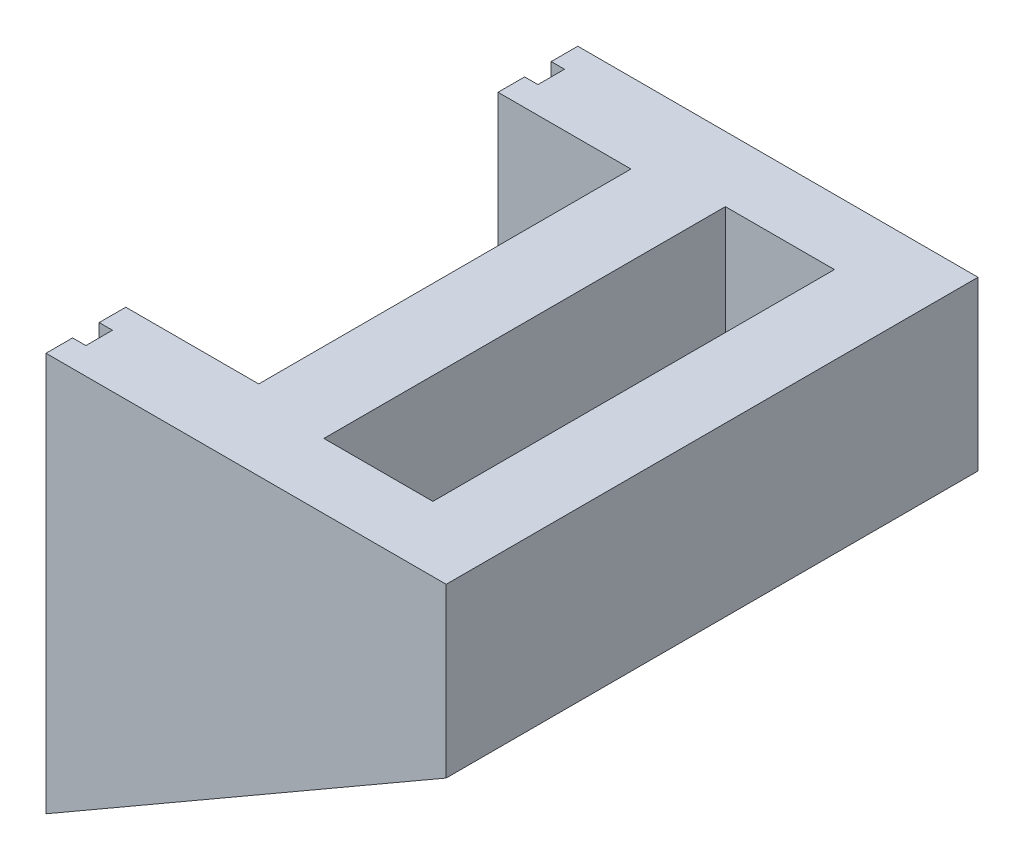
ISO-10303-21;
HEADER;
FILE_DESCRIPTION(('STEP AP214'),'2;1');
FILE_NAME('part.step','',(''),(''),'','','');
FILE_SCHEMA(('AUTOMOTIVE_DESIGN { 1 0 10303 214 1 1 1 1 }'));
ENDSEC;
DATA;
#1=APPLICATION_CONTEXT('core data for automotive mechanical design processes');
#2=APPLICATION_PROTOCOL_DEFINITION('international standard','automotive_design',2000,#1);
#3=PRODUCT_CONTEXT('',#1,'mechanical');
#4=PRODUCT('Part','Part','',(#3));
#5=PRODUCT_RELATED_PRODUCT_CATEGORY('part','',(#4));
#6=PRODUCT_DEFINITION_FORMATION('','',#4);
#7=PRODUCT_DEFINITION_CONTEXT('part definition',#1,'design');
#8=PRODUCT_DEFINITION('design','',#6,#7);
#9=PRODUCT_DEFINITION_SHAPE('','',#8);
#10=(LENGTH_UNIT() NAMED_UNIT(*) SI_UNIT(.MILLI.,.METRE.));
#11=(NAMED_UNIT(*) PLANE_ANGLE_UNIT() SI_UNIT($,.RADIAN.));
#12=(NAMED_UNIT(*) SI_UNIT($,.STERADIAN.) SOLID_ANGLE_UNIT());
#13=UNCERTAINTY_MEASURE_WITH_UNIT(LENGTH_MEASURE(1.E-05),#10,'distance_accuracy_value','');
#14=(GEOMETRIC_REPRESENTATION_CONTEXT(3) GLOBAL_UNCERTAINTY_ASSIGNED_CONTEXT((#13)) GLOBAL_UNIT_ASSIGNED_CONTEXT((#10,
#11,#12)) REPRESENTATION_CONTEXT('',''));
#15=CARTESIAN_POINT('',(0.,0.,0.));
#16=DIRECTION('',(0.,0.,1.));
#17=DIRECTION('',(1.,0.,0.));
#18=AXIS2_PLACEMENT_3D('',#15,#16,#17);
#19=CARTESIAN_POINT('',(0.,15.,0.));
#20=DIRECTION('',(0.,-1.,0.));
#21=DIRECTION('',(0.,0.,-1.));
#22=AXIS2_PLACEMENT_3D('',#19,#20,#21);
#23=PLANE('',#22);
#24=DIRECTION('',(0.,0.,-1.));
#25=VECTOR('',#24,1.);
#26=CARTESIAN_POINT('',(-2.05,15.,10.));
#27=LINE('',#26,#25);
#28=CARTESIAN_POINT('',(-2.05,15.,7.55));
#29=VERTEX_POINT('',#28);
#30=CARTESIAN_POINT('',(-2.05,15.,-7.55));
#31=VERTEX_POINT('',#30);
#32=EDGE_CURVE('E255',#29,#31,#27,.T.);
#33=ORIENTED_EDGE('',*,*,#32,.T.);
#34=DIRECTION('',(-1.,0.,0.));
#35=VECTOR('',#34,1.);
#36=CARTESIAN_POINT('',(-2.05,15.,-7.55));
#37=LINE('',#36,#35);
#38=CARTESIAN_POINT('',(2.05,15.,-7.55));
#39=VERTEX_POINT('',#38);
#40=EDGE_CURVE('E283',#39,#31,#37,.T.);
#41=ORIENTED_EDGE('',*,*,#40,.F.);
#42=DIRECTION('',(0.,0.,-1.));
#43=VECTOR('',#42,1.);
#44=CARTESIAN_POINT('',(2.05,15.,7.55));
#45=LINE('',#44,#43);
#46=CARTESIAN_POINT('',(2.05,15.,7.55));
#47=VERTEX_POINT('',#46);
#48=EDGE_CURVE('E260',#47,#39,#45,.T.);
#49=ORIENTED_EDGE('',*,*,#48,.F.);
#50=DIRECTION('',(1.,0.,0.));
#51=VECTOR('',#50,1.);
#52=CARTESIAN_POINT('',(-2.05,15.,7.55));
#53=LINE('',#52,#51);
#54=EDGE_CURVE('E285',#29,#47,#53,.T.);
#55=ORIENTED_EDGE('',*,*,#54,.F.);
#56=EDGE_LOOP('',(#33,#41,#49,#55));
#57=FACE_BOUND('',#56,.T.);
#58=DIRECTION('',(-1.,0.,0.));
#59=VECTOR('',#58,1.);
#60=CARTESIAN_POINT('',(-9.55,15.,9.00000000000001));
#61=LINE('',#60,#59);
#62=CARTESIAN_POINT('',(-9.55,15.,9.00000000000001));
#63=VERTEX_POINT('',#62);
#64=CARTESIAN_POINT('',(-10.05,15.,9.00000000000001));
#65=VERTEX_POINT('',#64);
#66=EDGE_CURVE('E207',#63,#65,#61,.T.);
#67=ORIENTED_EDGE('',*,*,#66,.T.);
#68=DIRECTION('',(0.,0.,-1.));
#69=VECTOR('',#68,1.);
#70=CARTESIAN_POINT('',(-10.05,15.,7.));
#71=LINE('',#70,#69);
#72=CARTESIAN_POINT('',(-10.05,15.,10.));
#73=VERTEX_POINT('',#72);
#74=EDGE_CURVE('E235',#73,#65,#71,.T.);
#75=ORIENTED_EDGE('',*,*,#74,.F.);
#76=DIRECTION('',(1.,0.,0.));
#77=VECTOR('',#76,1.);
#78=CARTESIAN_POINT('',(-5.,15.,10.));
#79=LINE('',#78,#77);
#80=CARTESIAN_POINT('',(5.,15.,10.));
#81=VERTEX_POINT('',#80);
#82=EDGE_CURVE('E310',#73,#81,#79,.T.);
#83=ORIENTED_EDGE('',*,*,#82,.T.);
#84=DIRECTION('',(0.,0.,-1.));
#85=VECTOR('',#84,1.);
#86=CARTESIAN_POINT('',(5.,15.,10.));
#87=LINE('',#86,#85);
#88=CARTESIAN_POINT('',(5.,15.,-10.));
#89=VERTEX_POINT('',#88);
#90=EDGE_CURVE('E300',#81,#89,#87,.T.);
#91=ORIENTED_EDGE('',*,*,#90,.T.);
#92=DIRECTION('',(-1.,0.,0.));
#93=VECTOR('',#92,1.);
#94=CARTESIAN_POINT('',(-5.,15.,-10.));
#95=LINE('',#94,#93);
#96=CARTESIAN_POINT('',(-10.05,15.,-10.));
#97=VERTEX_POINT('',#96);
#98=EDGE_CURVE('E307',#89,#97,#95,.T.);
#99=ORIENTED_EDGE('',*,*,#98,.T.);
#100=DIRECTION('',(0.,0.,-1.));
#101=VECTOR('',#100,1.);
#102=CARTESIAN_POINT('',(-10.05,15.,-7.));
#103=LINE('',#102,#101);
#104=CARTESIAN_POINT('',(-10.05,15.,-9.));
#105=VERTEX_POINT('',#104);
#106=EDGE_CURVE('E221',#105,#97,#103,.T.);
#107=ORIENTED_EDGE('',*,*,#106,.F.);
#108=DIRECTION('',(-1.,0.,0.));
#109=VECTOR('',#108,1.);
#110=CARTESIAN_POINT('',(-9.55,15.,-9.));
#111=LINE('',#110,#109);
#112=CARTESIAN_POINT('',(-9.55,15.,-9.));
#113=VERTEX_POINT('',#112);
#114=EDGE_CURVE('E346',#113,#105,#111,.T.);
#115=ORIENTED_EDGE('',*,*,#114,.F.);
#116=DIRECTION('',(0.,0.,-1.));
#117=VECTOR('',#116,1.);
#118=CARTESIAN_POINT('',(-9.55,15.,0.));
#119=LINE('',#118,#117);
#120=CARTESIAN_POINT('',(-9.55,15.,-8.));
#121=VERTEX_POINT('',#120);
#122=EDGE_CURVE('E374',#121,#113,#119,.T.);
#123=ORIENTED_EDGE('',*,*,#122,.F.);
#124=DIRECTION('',(-1.,0.,0.));
#125=VECTOR('',#124,1.);
#126=CARTESIAN_POINT('',(-9.55,15.,-8.));
#127=LINE('',#126,#125);
#128=CARTESIAN_POINT('',(-10.05,15.,-8.));
#129=VERTEX_POINT('',#128);
#130=EDGE_CURVE('E348',#121,#129,#127,.T.);
#131=ORIENTED_EDGE('',*,*,#130,.T.);
#132=CARTESIAN_POINT('',(-10.05,15.,-7.));
#133=VERTEX_POINT('',#132);
#134=EDGE_CURVE('E223',#133,#129,#103,.T.);
#135=ORIENTED_EDGE('',*,*,#134,.F.);
#136=DIRECTION('',(1.,0.,0.));
#137=VECTOR('',#136,1.);
#138=CARTESIAN_POINT('',(-10.05,15.,-7.));
#139=LINE('',#138,#137);
#140=CARTESIAN_POINT('',(-5.05,15.,-7.));
#141=VERTEX_POINT('',#140);
#142=EDGE_CURVE('E268',#133,#141,#139,.T.);
#143=ORIENTED_EDGE('',*,*,#142,.T.);
#144=DIRECTION('',(0.,0.,-1.));
#145=VECTOR('',#144,1.);
#146=CARTESIAN_POINT('',(-5.05,15.,10.));
#147=LINE('',#146,#145);
#148=CARTESIAN_POINT('',(-5.05,15.,7.));
#149=VERTEX_POINT('',#148);
#150=EDGE_CURVE('E258',#149,#141,#147,.T.);
#151=ORIENTED_EDGE('',*,*,#150,.F.);
#152=DIRECTION('',(1.,0.,0.));
#153=VECTOR('',#152,1.);
#154=CARTESIAN_POINT('',(-10.05,15.,7.));
#155=LINE('',#154,#153);
#156=CARTESIAN_POINT('',(-10.05,15.,7.));
#157=VERTEX_POINT('',#156);
#158=EDGE_CURVE('E252',#157,#149,#155,.T.);
#159=ORIENTED_EDGE('',*,*,#158,.F.);
#160=CARTESIAN_POINT('',(-10.05,15.,8.00000000000001));
#161=VERTEX_POINT('',#160);
#162=EDGE_CURVE('E193',#161,#157,#71,.T.);
#163=ORIENTED_EDGE('',*,*,#162,.F.);
#164=DIRECTION('',(-1.,0.,0.));
#165=VECTOR('',#164,1.);
#166=CARTESIAN_POINT('',(-9.55,15.,8.00000000000002));
#167=LINE('',#166,#165);
#168=CARTESIAN_POINT('',(-9.55,15.,8.00000000000002));
#169=VERTEX_POINT('',#168);
#170=EDGE_CURVE('E51',#169,#161,#167,.T.);
#171=ORIENTED_EDGE('',*,*,#170,.F.);
#172=DIRECTION('',(0.,0.,-1.));
#173=VECTOR('',#172,1.);
#174=CARTESIAN_POINT('',(-9.55,15.,0.));
#175=LINE('',#174,#173);
#176=EDGE_CURVE('E180',#63,#169,#175,.T.);
#177=ORIENTED_EDGE('',*,*,#176,.F.);
#178=EDGE_LOOP('',(#67,#75,#83,#91,#99,#107,#115,#123,#131,#135,#143,#151,#159,#163,#171,#177));
#179=FACE_BOUND('',#178,.T.);
#180=ADVANCED_FACE('F33',(#57,#179),#23,.F.);
#181=CARTESIAN_POINT('',(-10.05,0.,0.));
#182=DIRECTION('',(-1.,0.,0.));
#183=DIRECTION('',(0.,0.,1.));
#184=AXIS2_PLACEMENT_3D('',#181,#182,#183);
#185=PLANE('',#184);
#186=ORIENTED_EDGE('',*,*,#74,.T.);
#187=DIRECTION('',(0.,-1.,0.));
#188=VECTOR('',#187,1.);
#189=CARTESIAN_POINT('',(-10.05,0.,9.));
#190=LINE('',#189,#188);
#191=CARTESIAN_POINT('',(-10.05,0.99999999999999,9.));
#192=VERTEX_POINT('',#191);
#193=EDGE_CURVE('E189',#65,#192,#190,.T.);
#194=ORIENTED_EDGE('',*,*,#193,.T.);
#195=DIRECTION('',(0.,0.,-1.));
#196=VECTOR('',#195,1.);
#197=CARTESIAN_POINT('',(-10.05,1.,0.));
#198=LINE('',#197,#196);
#199=CARTESIAN_POINT('',(-10.05,1.,-9.));
#200=VERTEX_POINT('',#199);
#201=EDGE_CURVE('E334',#192,#200,#198,.T.);
#202=ORIENTED_EDGE('',*,*,#201,.T.);
#203=DIRECTION('',(0.,-1.,0.));
#204=VECTOR('',#203,1.);
#205=CARTESIAN_POINT('',(-10.05,0.,-9.));
#206=LINE('',#205,#204);
#207=EDGE_CURVE('E337',#105,#200,#206,.T.);
#208=ORIENTED_EDGE('',*,*,#207,.F.);
#209=ORIENTED_EDGE('',*,*,#106,.T.);
#210=DIRECTION('',(0.,-1.,0.));
#211=VECTOR('',#210,1.);
#212=CARTESIAN_POINT('',(-10.05,15.,-10.));
#213=LINE('',#212,#211);
#214=CARTESIAN_POINT('',(-10.05,0.,-10.));
#215=VERTEX_POINT('',#214);
#216=EDGE_CURVE('E226',#97,#215,#213,.T.);
#217=ORIENTED_EDGE('',*,*,#216,.T.);
#218=DIRECTION('',(0.,0.,1.));
#219=VECTOR('',#218,1.);
#220=CARTESIAN_POINT('',(-10.05,0.,-10.));
#221=LINE('',#220,#219);
#222=CARTESIAN_POINT('',(-10.05,0.,10.));
#223=VERTEX_POINT('',#222);
#224=EDGE_CURVE('E229',#215,#223,#221,.T.);
#225=ORIENTED_EDGE('',*,*,#224,.T.);
#226=DIRECTION('',(0.,1.,0.));
#227=VECTOR('',#226,1.);
#228=CARTESIAN_POINT('',(-10.05,15.,10.));
#229=LINE('',#228,#227);
#230=EDGE_CURVE('E232',#223,#73,#229,.T.);
#231=ORIENTED_EDGE('',*,*,#230,.T.);
#232=EDGE_LOOP('',(#186,#194,#202,#208,#209,#217,#225,#231));
#233=FACE_BOUND('',#232,.T.);
#234=ADVANCED_FACE('F324',(#233),#185,.T.);
#235=ORIENTED_EDGE('',*,*,#134,.T.);
#236=DIRECTION('',(0.,-1.,0.));
#237=VECTOR('',#236,1.);
#238=CARTESIAN_POINT('',(-10.05,0.,-8.));
#239=LINE('',#238,#237);
#240=CARTESIAN_POINT('',(-10.05,2.,-8.));
#241=VERTEX_POINT('',#240);
#242=EDGE_CURVE('E355',#129,#241,#239,.T.);
#243=ORIENTED_EDGE('',*,*,#242,.T.);
#244=DIRECTION('',(0.,0.,1.));
#245=VECTOR('',#244,1.);
#246=CARTESIAN_POINT('',(-10.05,2.,0.));
#247=LINE('',#246,#245);
#248=CARTESIAN_POINT('',(-10.05,1.99999999999999,8.));
#249=VERTEX_POINT('',#248);
#250=EDGE_CURVE('E360',#241,#249,#247,.T.);
#251=ORIENTED_EDGE('',*,*,#250,.T.);
#252=DIRECTION('',(0.,-1.,0.));
#253=VECTOR('',#252,1.);
#254=CARTESIAN_POINT('',(-10.05,0.,8.));
#255=LINE('',#254,#253);
#256=EDGE_CURVE('E363',#161,#249,#255,.T.);
#257=ORIENTED_EDGE('',*,*,#256,.F.);
#258=ORIENTED_EDGE('',*,*,#162,.T.);
#259=DIRECTION('',(0.,-1.,0.));
#260=VECTOR('',#259,1.);
#261=CARTESIAN_POINT('',(-10.05,15.,7.));
#262=LINE('',#261,#260);
#263=CARTESIAN_POINT('',(-10.05,3.,7.));
#264=VERTEX_POINT('',#263);
#265=EDGE_CURVE('E238',#157,#264,#262,.T.);
#266=ORIENTED_EDGE('',*,*,#265,.T.);
#267=DIRECTION('',(0.,0.,-1.));
#268=VECTOR('',#267,1.);
#269=CARTESIAN_POINT('',(-10.05,3.,-7.));
#270=LINE('',#269,#268);
#271=CARTESIAN_POINT('',(-10.05,3.,-7.));
#272=VERTEX_POINT('',#271);
#273=EDGE_CURVE('E240',#264,#272,#270,.T.);
#274=ORIENTED_EDGE('',*,*,#273,.T.);
#275=DIRECTION('',(0.,1.,0.));
#276=VECTOR('',#275,1.);
#277=CARTESIAN_POINT('',(-10.05,15.,-7.));
#278=LINE('',#277,#276);
#279=EDGE_CURVE('E218',#272,#133,#278,.T.);
#280=ORIENTED_EDGE('',*,*,#279,.T.);
#281=EDGE_LOOP('',(#235,#243,#251,#257,#258,#266,#274,#280));
#282=FACE_BOUND('',#281,.T.);
#283=ADVANCED_FACE('F365',(#282),#185,.T.);
#284=CARTESIAN_POINT('',(-5.05,0.,0.));
#285=DIRECTION('',(1.,0.,0.));
#286=DIRECTION('',(0.,0.,-1.));
#287=AXIS2_PLACEMENT_3D('',#284,#285,#286);
#288=PLANE('',#287);
#289=DIRECTION('',(0.,1.,0.));
#290=VECTOR('',#289,1.);
#291=CARTESIAN_POINT('',(-5.05,15.,-7.));
#292=LINE('',#291,#290);
#293=CARTESIAN_POINT('',(-5.05,3.,-7.));
#294=VERTEX_POINT('',#293);
#295=EDGE_CURVE('E37',#294,#141,#292,.T.);
#296=ORIENTED_EDGE('',*,*,#295,.F.);
#297=DIRECTION('',(0.,0.,-1.));
#298=VECTOR('',#297,1.);
#299=CARTESIAN_POINT('',(-5.05,3.,-7.));
#300=LINE('',#299,#298);
#301=CARTESIAN_POINT('',(-5.05,3.,7.));
#302=VERTEX_POINT('',#301);
#303=EDGE_CURVE('E222',#302,#294,#300,.T.);
#304=ORIENTED_EDGE('',*,*,#303,.F.);
#305=DIRECTION('',(0.,-1.,0.));
#306=VECTOR('',#305,1.);
#307=CARTESIAN_POINT('',(-5.05,15.,7.));
#308=LINE('',#307,#306);
#309=EDGE_CURVE('E246',#149,#302,#308,.T.);
#310=ORIENTED_EDGE('',*,*,#309,.F.);
#311=ORIENTED_EDGE('',*,*,#150,.T.);
#312=EDGE_LOOP('',(#296,#304,#310,#311));
#313=FACE_BOUND('',#312,.T.);
#314=ADVANCED_FACE('F412',(#313),#288,.F.);
#315=CARTESIAN_POINT('',(5.,15.,10.));
#316=DIRECTION('',(-1.,0.,0.));
#317=DIRECTION('',(0.,0.,1.));
#318=AXIS2_PLACEMENT_3D('',#315,#316,#317);
#319=PLANE('',#318);
#320=DIRECTION('',(0.,-1.,0.));
#321=VECTOR('',#320,1.);
#322=CARTESIAN_POINT('',(5.,15.,10.));
#323=LINE('',#322,#321);
#324=CARTESIAN_POINT('',(5.,8.6891215513039,10.));
#325=VERTEX_POINT('',#324);
#326=EDGE_CURVE('E43',#81,#325,#323,.T.);
#327=ORIENTED_EDGE('',*,*,#326,.T.);
#328=DIRECTION('',(0.,0.,1.));
#329=VECTOR('',#328,1.);
#330=CARTESIAN_POINT('',(5.,8.6891215513039,-10.));
#331=LINE('',#330,#329);
#332=CARTESIAN_POINT('',(5.,8.6891215513039,-10.));
#333=VERTEX_POINT('',#332);
#334=EDGE_CURVE('E204',#333,#325,#331,.T.);
#335=ORIENTED_EDGE('',*,*,#334,.F.);
#336=DIRECTION('',(0.,-1.,0.));
#337=VECTOR('',#336,1.);
#338=CARTESIAN_POINT('',(5.,15.,-10.));
#339=LINE('',#338,#337);
#340=EDGE_CURVE('E11',#89,#333,#339,.T.);
#341=ORIENTED_EDGE('',*,*,#340,.F.);
#342=ORIENTED_EDGE('',*,*,#90,.F.);
#343=EDGE_LOOP('',(#327,#335,#341,#342));
#344=FACE_BOUND('',#343,.T.);
#345=ADVANCED_FACE('F35',(#344),#319,.F.);
#346=CARTESIAN_POINT('',(-5.,15.,-10.));
#347=DIRECTION('',(0.,0.,1.));
#348=DIRECTION('',(1.,0.,0.));
#349=AXIS2_PLACEMENT_3D('',#346,#347,#348);
#350=PLANE('',#349);
#351=ORIENTED_EDGE('',*,*,#340,.T.);
#352=DIRECTION('',(-0.866025403784438,-0.500000000000001,0.));
#353=VECTOR('',#352,1.);
#354=CARTESIAN_POINT('',(-10.05,0.,-10.));
#355=LINE('',#354,#353);
#356=EDGE_CURVE('E201',#333,#215,#355,.T.);
#357=ORIENTED_EDGE('',*,*,#356,.T.);
#358=ORIENTED_EDGE('',*,*,#216,.F.);
#359=ORIENTED_EDGE('',*,*,#98,.F.);
#360=EDGE_LOOP('',(#351,#357,#358,#359));
#361=FACE_BOUND('',#360,.T.);
#362=ADVANCED_FACE('F330',(#361),#350,.F.);
#363=CARTESIAN_POINT('',(-5.,15.,10.));
#364=DIRECTION('',(0.,0.,-1.));
#365=DIRECTION('',(-1.,0.,0.));
#366=AXIS2_PLACEMENT_3D('',#363,#364,#365);
#367=PLANE('',#366);
#368=ORIENTED_EDGE('',*,*,#230,.F.);
#369=DIRECTION('',(-0.866025403784438,-0.500000000000001,0.));
#370=VECTOR('',#369,1.);
#371=CARTESIAN_POINT('',(-10.05,0.,10.));
#372=LINE('',#371,#370);
#373=EDGE_CURVE('E205',#325,#223,#372,.T.);
#374=ORIENTED_EDGE('',*,*,#373,.F.);
#375=ORIENTED_EDGE('',*,*,#326,.F.);
#376=ORIENTED_EDGE('',*,*,#82,.F.);
#377=EDGE_LOOP('',(#368,#374,#375,#376));
#378=FACE_BOUND('',#377,.T.);
#379=ADVANCED_FACE('F320',(#378),#367,.F.);
#380=CARTESIAN_POINT('',(2.05,0.,7.55));
#381=DIRECTION('',(1.,0.,0.));
#382=DIRECTION('',(0.,0.,-1.));
#383=AXIS2_PLACEMENT_3D('',#380,#381,#382);
#384=PLANE('',#383);
#385=DIRECTION('',(0.,1.,0.));
#386=VECTOR('',#385,1.);
#387=CARTESIAN_POINT('',(2.05,0.,-7.55));
#388=LINE('',#387,#386);
#389=CARTESIAN_POINT('',(2.05,6.9859382571945,-7.55));
#390=VERTEX_POINT('',#389);
#391=EDGE_CURVE('E293',#390,#39,#388,.T.);
#392=ORIENTED_EDGE('',*,*,#391,.F.);
#393=DIRECTION('',(0.,0.,1.));
#394=VECTOR('',#393,1.);
#395=CARTESIAN_POINT('',(2.05,6.9859382571945,7.55));
#396=LINE('',#395,#394);
#397=CARTESIAN_POINT('',(2.05,6.9859382571945,7.55));
#398=VERTEX_POINT('',#397);
#399=EDGE_CURVE('E215',#390,#398,#396,.T.);
#400=ORIENTED_EDGE('',*,*,#399,.T.);
#401=DIRECTION('',(0.,1.,0.));
#402=VECTOR('',#401,1.);
#403=CARTESIAN_POINT('',(2.05,0.,7.55));
#404=LINE('',#403,#402);
#405=EDGE_CURVE('E298',#398,#47,#404,.T.);
#406=ORIENTED_EDGE('',*,*,#405,.T.);
#407=ORIENTED_EDGE('',*,*,#48,.T.);
#408=EDGE_LOOP('',(#392,#400,#406,#407));
#409=FACE_BOUND('',#408,.T.);
#410=ADVANCED_FACE('F405',(#409),#384,.F.);
#411=CARTESIAN_POINT('',(-2.05,0.,7.55));
#412=DIRECTION('',(0.,0.,1.));
#413=DIRECTION('',(1.,0.,0.));
#414=AXIS2_PLACEMENT_3D('',#411,#412,#413);
#415=PLANE('',#414);
#416=ORIENTED_EDGE('',*,*,#405,.F.);
#417=DIRECTION('',(-0.866025403784438,-0.500000000000001,0.));
#418=VECTOR('',#417,1.);
#419=CARTESIAN_POINT('',(-4.05000000000001,3.46410161513776,7.55));
#420=LINE('',#419,#418);
#421=CARTESIAN_POINT('',(-2.05,4.61880215351702,7.55));
#422=VERTEX_POINT('',#421);
#423=EDGE_CURVE('E212',#398,#422,#420,.T.);
#424=ORIENTED_EDGE('',*,*,#423,.T.);
#425=DIRECTION('',(0.,1.,0.));
#426=VECTOR('',#425,1.);
#427=CARTESIAN_POINT('',(-2.05,0.,7.55));
#428=LINE('',#427,#426);
#429=EDGE_CURVE('E301',#422,#29,#428,.T.);
#430=ORIENTED_EDGE('',*,*,#429,.T.);
#431=ORIENTED_EDGE('',*,*,#54,.T.);
#432=EDGE_LOOP('',(#416,#424,#430,#431));
#433=FACE_BOUND('',#432,.T.);
#434=ADVANCED_FACE('F428',(#433),#415,.F.);
#435=CARTESIAN_POINT('',(-2.05,0.,-7.55));
#436=DIRECTION('',(0.,0.,-1.));
#437=DIRECTION('',(-1.,0.,0.));
#438=AXIS2_PLACEMENT_3D('',#435,#436,#437);
#439=PLANE('',#438);
#440=DIRECTION('',(0.,1.,0.));
#441=VECTOR('',#440,1.);
#442=CARTESIAN_POINT('',(-2.05,0.,-7.55));
#443=LINE('',#442,#441);
#444=CARTESIAN_POINT('',(-2.05,4.61880215351702,-7.55));
#445=VERTEX_POINT('',#444);
#446=EDGE_CURVE('E291',#445,#31,#443,.T.);
#447=ORIENTED_EDGE('',*,*,#446,.F.);
#448=DIRECTION('',(0.866025403784438,0.500000000000001,0.));
#449=VECTOR('',#448,1.);
#450=CARTESIAN_POINT('',(-4.05000000000001,3.46410161513776,-7.55));
#451=LINE('',#450,#449);
#452=EDGE_CURVE('E59',#445,#390,#451,.T.);
#453=ORIENTED_EDGE('',*,*,#452,.T.);
#454=ORIENTED_EDGE('',*,*,#391,.T.);
#455=ORIENTED_EDGE('',*,*,#40,.T.);
#456=EDGE_LOOP('',(#447,#453,#454,#455));
#457=FACE_BOUND('',#456,.T.);
#458=ADVANCED_FACE('F290',(#457),#439,.F.);
#459=CARTESIAN_POINT('',(-2.05,0.,0.));
#460=DIRECTION('',(1.,0.,0.));
#461=DIRECTION('',(0.,0.,-1.));
#462=AXIS2_PLACEMENT_3D('',#459,#460,#461);
#463=PLANE('',#462);
#464=DIRECTION('',(0.,0.,1.));
#465=VECTOR('',#464,1.);
#466=CARTESIAN_POINT('',(-2.05,4.61880215351702,0.));
#467=LINE('',#466,#465);
#468=EDGE_CURVE('E209',#445,#422,#467,.T.);
#469=ORIENTED_EDGE('',*,*,#468,.F.);
#470=ORIENTED_EDGE('',*,*,#446,.T.);
#471=ORIENTED_EDGE('',*,*,#32,.F.);
#472=ORIENTED_EDGE('',*,*,#429,.F.);
#473=EDGE_LOOP('',(#469,#470,#471,#472));
#474=FACE_BOUND('',#473,.T.);
#475=ADVANCED_FACE('F425',(#474),#463,.T.);
#476=CARTESIAN_POINT('',(-10.05,15.,-7.));
#477=DIRECTION('',(0.,0.,-1.));
#478=DIRECTION('',(0.,1.,0.));
#479=AXIS2_PLACEMENT_3D('',#476,#477,#478);
#480=PLANE('',#479);
#481=ORIENTED_EDGE('',*,*,#295,.T.);
#482=ORIENTED_EDGE('',*,*,#142,.F.);
#483=ORIENTED_EDGE('',*,*,#279,.F.);
#484=DIRECTION('',(1.,0.,0.));
#485=VECTOR('',#484,1.);
#486=CARTESIAN_POINT('',(-10.05,3.,-7.));
#487=LINE('',#486,#485);
#488=EDGE_CURVE('E241',#272,#294,#487,.T.);
#489=ORIENTED_EDGE('',*,*,#488,.T.);
#490=EDGE_LOOP('',(#481,#482,#483,#489));
#491=FACE_BOUND('',#490,.T.);
#492=ADVANCED_FACE('F423',(#491),#480,.F.);
#493=CARTESIAN_POINT('',(-10.05,15.,7.));
#494=DIRECTION('',(0.,0.,1.));
#495=DIRECTION('',(0.,-1.,0.));
#496=AXIS2_PLACEMENT_3D('',#493,#494,#495);
#497=PLANE('',#496);
#498=ORIENTED_EDGE('',*,*,#309,.T.);
#499=DIRECTION('',(1.,0.,0.));
#500=VECTOR('',#499,1.);
#501=CARTESIAN_POINT('',(-10.05,3.,7.));
#502=LINE('',#501,#500);
#503=EDGE_CURVE('E249',#264,#302,#502,.T.);
#504=ORIENTED_EDGE('',*,*,#503,.F.);
#505=ORIENTED_EDGE('',*,*,#265,.F.);
#506=ORIENTED_EDGE('',*,*,#158,.T.);
#507=EDGE_LOOP('',(#498,#504,#505,#506));
#508=FACE_BOUND('',#507,.T.);
#509=ADVANCED_FACE('F448',(#508),#497,.F.);
#510=CARTESIAN_POINT('',(-10.05,3.,-7.));
#511=DIRECTION('',(0.,-1.,0.));
#512=DIRECTION('',(0.,0.,-1.));
#513=AXIS2_PLACEMENT_3D('',#510,#511,#512);
#514=PLANE('',#513);
#515=ORIENTED_EDGE('',*,*,#303,.T.);
#516=ORIENTED_EDGE('',*,*,#488,.F.);
#517=ORIENTED_EDGE('',*,*,#273,.F.);
#518=ORIENTED_EDGE('',*,*,#503,.T.);
#519=EDGE_LOOP('',(#515,#516,#517,#518));
#520=FACE_BOUND('',#519,.T.);
#521=ADVANCED_FACE('F394',(#520),#514,.F.);
#522=CARTESIAN_POINT('',(-10.05,0.,-10.));
#523=DIRECTION('',(-0.500000000000001,0.866025403784438,0.));
#524=DIRECTION('',(-0.866025403784438,-0.500000000000001,0.));
#525=AXIS2_PLACEMENT_3D('',#522,#523,#524);
#526=PLANE('',#525);
#527=ORIENTED_EDGE('',*,*,#373,.T.);
#528=ORIENTED_EDGE('',*,*,#224,.F.);
#529=ORIENTED_EDGE('',*,*,#356,.F.);
#530=ORIENTED_EDGE('',*,*,#334,.T.);
#531=EDGE_LOOP('',(#527,#528,#529,#530));
#532=FACE_BOUND('',#531,.T.);
#533=ORIENTED_EDGE('',*,*,#452,.F.);
#534=ORIENTED_EDGE('',*,*,#468,.T.);
#535=ORIENTED_EDGE('',*,*,#423,.F.);
#536=ORIENTED_EDGE('',*,*,#399,.F.);
#537=EDGE_LOOP('',(#533,#534,#535,#536));
#538=FACE_BOUND('',#537,.T.);
#539=ADVANCED_FACE('F322',(#532,#538),#526,.F.);
#540=CARTESIAN_POINT('',(-9.55,0.,9.));
#541=DIRECTION('',(0.,0.,-1.));
#542=DIRECTION('',(0.,1.,0.));
#543=AXIS2_PLACEMENT_3D('',#540,#541,#542);
#544=PLANE('',#543);
#545=ORIENTED_EDGE('',*,*,#193,.F.);
#546=ORIENTED_EDGE('',*,*,#66,.F.);
#547=DIRECTION('',(0.,-1.,0.));
#548=VECTOR('',#547,1.);
#549=CARTESIAN_POINT('',(-9.55,0.,9.));
#550=LINE('',#549,#548);
#551=CARTESIAN_POINT('',(-9.55,0.99999999999999,9.));
#552=VERTEX_POINT('',#551);
#553=EDGE_CURVE('E186',#63,#552,#550,.T.);
#554=ORIENTED_EDGE('',*,*,#553,.T.);
#555=DIRECTION('',(-1.,0.,0.));
#556=VECTOR('',#555,1.);
#557=CARTESIAN_POINT('',(-9.55,0.99999999999999,9.));
#558=LINE('',#557,#556);
#559=EDGE_CURVE('E342',#552,#192,#558,.T.);
#560=ORIENTED_EDGE('',*,*,#559,.T.);
#561=EDGE_LOOP('',(#545,#546,#554,#560));
#562=FACE_BOUND('',#561,.T.);
#563=ADVANCED_FACE('F386',(#562),#544,.T.);
#564=CARTESIAN_POINT('',(-9.55,1.,0.));
#565=DIRECTION('',(0.,1.,0.));
#566=DIRECTION('',(0.,0.,1.));
#567=AXIS2_PLACEMENT_3D('',#564,#565,#566);
#568=PLANE('',#567);
#569=ORIENTED_EDGE('',*,*,#201,.F.);
#570=ORIENTED_EDGE('',*,*,#559,.F.);
#571=DIRECTION('',(0.,0.,-1.));
#572=VECTOR('',#571,1.);
#573=CARTESIAN_POINT('',(-9.55,1.,0.));
#574=LINE('',#573,#572);
#575=CARTESIAN_POINT('',(-9.55,1.,-9.));
#576=VERTEX_POINT('',#575);
#577=EDGE_CURVE('E197',#552,#576,#574,.T.);
#578=ORIENTED_EDGE('',*,*,#577,.T.);
#579=DIRECTION('',(-1.,0.,0.));
#580=VECTOR('',#579,1.);
#581=CARTESIAN_POINT('',(-9.55,1.,-9.));
#582=LINE('',#581,#580);
#583=EDGE_CURVE('E344',#576,#200,#582,.T.);
#584=ORIENTED_EDGE('',*,*,#583,.T.);
#585=EDGE_LOOP('',(#569,#570,#578,#584));
#586=FACE_BOUND('',#585,.T.);
#587=ADVANCED_FACE('F385',(#586),#568,.T.);
#588=CARTESIAN_POINT('',(-9.55,0.,-9.));
#589=DIRECTION('',(0.,0.,-1.));
#590=DIRECTION('',(-1.,0.,0.));
#591=AXIS2_PLACEMENT_3D('',#588,#589,#590);
#592=PLANE('',#591);
#593=ORIENTED_EDGE('',*,*,#207,.T.);
#594=ORIENTED_EDGE('',*,*,#583,.F.);
#595=DIRECTION('',(0.,-1.,0.));
#596=VECTOR('',#595,1.);
#597=CARTESIAN_POINT('',(-9.55,0.,-9.));
#598=LINE('',#597,#596);
#599=EDGE_CURVE('E371',#113,#576,#598,.T.);
#600=ORIENTED_EDGE('',*,*,#599,.F.);
#601=ORIENTED_EDGE('',*,*,#114,.T.);
#602=EDGE_LOOP('',(#593,#594,#600,#601));
#603=FACE_BOUND('',#602,.T.);
#604=ADVANCED_FACE('F381',(#603),#592,.F.);
#605=CARTESIAN_POINT('',(-9.55,0.,-8.));
#606=DIRECTION('',(0.,0.,-1.));
#607=DIRECTION('',(-1.,0.,0.));
#608=AXIS2_PLACEMENT_3D('',#605,#606,#607);
#609=PLANE('',#608);
#610=ORIENTED_EDGE('',*,*,#242,.F.);
#611=ORIENTED_EDGE('',*,*,#130,.F.);
#612=DIRECTION('',(0.,-1.,0.));
#613=VECTOR('',#612,1.);
#614=CARTESIAN_POINT('',(-9.55,0.,-8.));
#615=LINE('',#614,#613);
#616=CARTESIAN_POINT('',(-9.55,2.,-8.));
#617=VERTEX_POINT('',#616);
#618=EDGE_CURVE('E357',#121,#617,#615,.T.);
#619=ORIENTED_EDGE('',*,*,#618,.T.);
#620=DIRECTION('',(-1.,0.,0.));
#621=VECTOR('',#620,1.);
#622=CARTESIAN_POINT('',(-9.55,2.,-8.));
#623=LINE('',#622,#621);
#624=EDGE_CURVE('E195',#617,#241,#623,.T.);
#625=ORIENTED_EDGE('',*,*,#624,.T.);
#626=EDGE_LOOP('',(#610,#611,#619,#625));
#627=FACE_BOUND('',#626,.T.);
#628=ADVANCED_FACE('F353',(#627),#609,.T.);
#629=CARTESIAN_POINT('',(-9.55,2.,0.));
#630=DIRECTION('',(0.,-1.,0.));
#631=DIRECTION('',(0.,0.,-1.));
#632=AXIS2_PLACEMENT_3D('',#629,#630,#631);
#633=PLANE('',#632);
#634=ORIENTED_EDGE('',*,*,#250,.F.);
#635=ORIENTED_EDGE('',*,*,#624,.F.);
#636=DIRECTION('',(0.,0.,1.));
#637=VECTOR('',#636,1.);
#638=CARTESIAN_POINT('',(-9.55,2.,0.));
#639=LINE('',#638,#637);
#640=CARTESIAN_POINT('',(-9.55,1.99999999999999,8.));
#641=VERTEX_POINT('',#640);
#642=EDGE_CURVE('E179',#617,#641,#639,.T.);
#643=ORIENTED_EDGE('',*,*,#642,.T.);
#644=DIRECTION('',(-1.,0.,0.));
#645=VECTOR('',#644,1.);
#646=CARTESIAN_POINT('',(-9.55,1.99999999999999,8.));
#647=LINE('',#646,#645);
#648=EDGE_CURVE('E176',#641,#249,#647,.T.);
#649=ORIENTED_EDGE('',*,*,#648,.T.);
#650=EDGE_LOOP('',(#634,#635,#643,#649));
#651=FACE_BOUND('',#650,.T.);
#652=ADVANCED_FACE('F361',(#651),#633,.T.);
#653=CARTESIAN_POINT('',(-9.55,0.,8.));
#654=DIRECTION('',(0.,0.,-1.));
#655=DIRECTION('',(0.,1.,0.));
#656=AXIS2_PLACEMENT_3D('',#653,#654,#655);
#657=PLANE('',#656);
#658=ORIENTED_EDGE('',*,*,#256,.T.);
#659=ORIENTED_EDGE('',*,*,#648,.F.);
#660=DIRECTION('',(0.,-1.,0.));
#661=VECTOR('',#660,1.);
#662=CARTESIAN_POINT('',(-9.55,0.,8.));
#663=LINE('',#662,#661);
#664=EDGE_CURVE('E173',#169,#641,#663,.T.);
#665=ORIENTED_EDGE('',*,*,#664,.F.);
#666=ORIENTED_EDGE('',*,*,#170,.T.);
#667=EDGE_LOOP('',(#658,#659,#665,#666));
#668=FACE_BOUND('',#667,.T.);
#669=ADVANCED_FACE('F175',(#668),#657,.F.);
#670=CARTESIAN_POINT('',(-9.55,0.,0.));
#671=DIRECTION('',(-1.,0.,0.));
#672=DIRECTION('',(0.,0.,1.));
#673=AXIS2_PLACEMENT_3D('',#670,#671,#672);
#674=PLANE('',#673);
#675=ORIENTED_EDGE('',*,*,#176,.T.);
#676=ORIENTED_EDGE('',*,*,#664,.T.);
#677=ORIENTED_EDGE('',*,*,#642,.F.);
#678=ORIENTED_EDGE('',*,*,#618,.F.);
#679=ORIENTED_EDGE('',*,*,#122,.T.);
#680=ORIENTED_EDGE('',*,*,#599,.T.);
#681=ORIENTED_EDGE('',*,*,#577,.F.);
#682=ORIENTED_EDGE('',*,*,#553,.F.);
#683=EDGE_LOOP('',(#675,#676,#677,#678,#679,#680,#681,#682));
#684=FACE_BOUND('',#683,.T.);
#685=ADVANCED_FACE('F184',(#684),#674,.T.);
#686=CLOSED_SHELL('',(#180,#234,#283,#314,#345,#362,#379,#410,#434,#458,#475,#492,#509,#521,
#539,#563,#587,#604,#628,#652,#669,#685));
#687=MANIFOLD_SOLID_BREP('B2',#686);
#688=ADVANCED_BREP_SHAPE_REPRESENTATION('',(#18,#687),#14);
#689=SHAPE_DEFINITION_REPRESENTATION(#9,#688);
ENDSEC;
END-ISO-10303-21;
